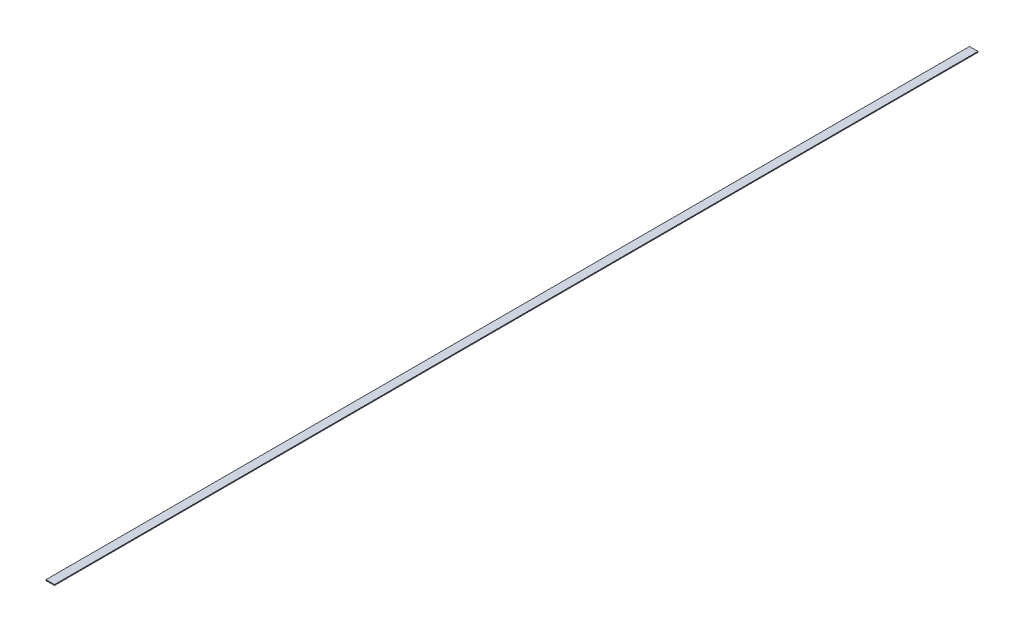
ISO-10303-21;
HEADER;
FILE_DESCRIPTION(('STEP AP214'),'2;1');
FILE_NAME('part.step','',(''),(''),'','','');
FILE_SCHEMA(('AUTOMOTIVE_DESIGN { 1 0 10303 214 1 1 1 1 }'));
ENDSEC;
DATA;
#1=APPLICATION_CONTEXT('core data for automotive mechanical design processes');
#2=APPLICATION_PROTOCOL_DEFINITION('international standard','automotive_design',2000,#1);
#3=PRODUCT_CONTEXT('',#1,'mechanical');
#4=PRODUCT('Part','Part','',(#3));
#5=PRODUCT_RELATED_PRODUCT_CATEGORY('part','',(#4));
#6=PRODUCT_DEFINITION_FORMATION('','',#4);
#7=PRODUCT_DEFINITION_CONTEXT('part definition',#1,'design');
#8=PRODUCT_DEFINITION('design','',#6,#7);
#9=PRODUCT_DEFINITION_SHAPE('','',#8);
#10=(LENGTH_UNIT() NAMED_UNIT(*) SI_UNIT(.MILLI.,.METRE.));
#11=(NAMED_UNIT(*) PLANE_ANGLE_UNIT() SI_UNIT($,.RADIAN.));
#12=(NAMED_UNIT(*) SI_UNIT($,.STERADIAN.) SOLID_ANGLE_UNIT());
#13=UNCERTAINTY_MEASURE_WITH_UNIT(LENGTH_MEASURE(1.E-05),#10,'distance_accuracy_value','');
#14=(GEOMETRIC_REPRESENTATION_CONTEXT(3) GLOBAL_UNCERTAINTY_ASSIGNED_CONTEXT((#13)) GLOBAL_UNIT_ASSIGNED_CONTEXT((#10,
#11,#12)) REPRESENTATION_CONTEXT('',''));
#15=CARTESIAN_POINT('',(0.,0.,0.));
#16=DIRECTION('',(0.,0.,1.));
#17=DIRECTION('',(1.,0.,0.));
#18=AXIS2_PLACEMENT_3D('',#15,#16,#17);
#19=CARTESIAN_POINT('',(0.,5.08,0.));
#20=DIRECTION('',(1.,0.,0.));
#21=DIRECTION('',(0.,0.,-1.));
#22=AXIS2_PLACEMENT_3D('',#19,#20,#21);
#23=PLANE('',#22);
#24=DIRECTION('',(0.,0.,1.));
#25=VECTOR('',#24,1.);
#26=CARTESIAN_POINT('',(0.,0.,0.));
#27=LINE('',#26,#25);
#28=CARTESIAN_POINT('',(0.,0.,-5518.15));
#29=VERTEX_POINT('',#28);
#30=CARTESIAN_POINT('',(0.,0.,0.));
#31=VERTEX_POINT('',#30);
#32=EDGE_CURVE('E97',#29,#31,#27,.T.);
#33=ORIENTED_EDGE('',*,*,#32,.T.);
#34=DIRECTION('',(0.,-1.,0.));
#35=VECTOR('',#34,1.);
#36=CARTESIAN_POINT('',(0.,5.08,0.));
#37=LINE('',#36,#35);
#38=CARTESIAN_POINT('',(0.,5.08,0.));
#39=VERTEX_POINT('',#38);
#40=EDGE_CURVE('E11',#39,#31,#37,.T.);
#41=ORIENTED_EDGE('',*,*,#40,.F.);
#42=DIRECTION('',(0.,0.,1.));
#43=VECTOR('',#42,1.);
#44=CARTESIAN_POINT('',(0.,5.08,0.));
#45=LINE('',#44,#43);
#46=CARTESIAN_POINT('',(0.,5.08,-5518.15));
#47=VERTEX_POINT('',#46);
#48=EDGE_CURVE('E85',#47,#39,#45,.T.);
#49=ORIENTED_EDGE('',*,*,#48,.F.);
#50=DIRECTION('',(0.,-1.,0.));
#51=VECTOR('',#50,1.);
#52=CARTESIAN_POINT('',(0.,5.08,-5518.15));
#53=LINE('',#52,#51);
#54=EDGE_CURVE('E93',#47,#29,#53,.T.);
#55=ORIENTED_EDGE('',*,*,#54,.T.);
#56=EDGE_LOOP('',(#33,#41,#49,#55));
#57=FACE_BOUND('',#56,.T.);
#58=ADVANCED_FACE('F34',(#57),#23,.F.);
#59=CARTESIAN_POINT('',(0.,5.08,0.));
#60=DIRECTION('',(0.,0.,-1.));
#61=DIRECTION('',(-1.,0.,0.));
#62=AXIS2_PLACEMENT_3D('',#59,#60,#61);
#63=PLANE('',#62);
#64=DIRECTION('',(1.,0.,0.));
#65=VECTOR('',#64,1.);
#66=CARTESIAN_POINT('',(0.,0.,0.));
#67=LINE('',#66,#65);
#68=CARTESIAN_POINT('',(50.8,0.,0.));
#69=VERTEX_POINT('',#68);
#70=EDGE_CURVE('E89',#31,#69,#67,.T.);
#71=ORIENTED_EDGE('',*,*,#70,.T.);
#72=DIRECTION('',(0.,-1.,0.));
#73=VECTOR('',#72,1.);
#74=CARTESIAN_POINT('',(50.8,5.08,0.));
#75=LINE('',#74,#73);
#76=CARTESIAN_POINT('',(50.8,5.08,0.));
#77=VERTEX_POINT('',#76);
#78=EDGE_CURVE('E42',#77,#69,#75,.T.);
#79=ORIENTED_EDGE('',*,*,#78,.F.);
#80=DIRECTION('',(1.,0.,0.));
#81=VECTOR('',#80,1.);
#82=CARTESIAN_POINT('',(0.,5.08,0.));
#83=LINE('',#82,#81);
#84=EDGE_CURVE('E80',#39,#77,#83,.T.);
#85=ORIENTED_EDGE('',*,*,#84,.F.);
#86=ORIENTED_EDGE('',*,*,#40,.T.);
#87=EDGE_LOOP('',(#71,#79,#85,#86));
#88=FACE_BOUND('',#87,.T.);
#89=ADVANCED_FACE('F88',(#88),#63,.F.);
#90=CARTESIAN_POINT('',(50.8,5.08,0.));
#91=DIRECTION('',(-1.,0.,0.));
#92=DIRECTION('',(0.,0.,1.));
#93=AXIS2_PLACEMENT_3D('',#90,#91,#92);
#94=PLANE('',#93);
#95=DIRECTION('',(0.,0.,-1.));
#96=VECTOR('',#95,1.);
#97=CARTESIAN_POINT('',(50.8,0.,0.));
#98=LINE('',#97,#96);
#99=CARTESIAN_POINT('',(50.8,0.,-5518.15));
#100=VERTEX_POINT('',#99);
#101=EDGE_CURVE('E67',#69,#100,#98,.T.);
#102=ORIENTED_EDGE('',*,*,#101,.T.);
#103=DIRECTION('',(0.,-1.,0.));
#104=VECTOR('',#103,1.);
#105=CARTESIAN_POINT('',(50.8,5.08,-5518.15));
#106=LINE('',#105,#104);
#107=CARTESIAN_POINT('',(50.8,5.08,-5518.15));
#108=VERTEX_POINT('',#107);
#109=EDGE_CURVE('E90',#108,#100,#106,.T.);
#110=ORIENTED_EDGE('',*,*,#109,.F.);
#111=DIRECTION('',(0.,0.,-1.));
#112=VECTOR('',#111,1.);
#113=CARTESIAN_POINT('',(50.8,5.08,0.));
#114=LINE('',#113,#112);
#115=EDGE_CURVE('E83',#77,#108,#114,.T.);
#116=ORIENTED_EDGE('',*,*,#115,.F.);
#117=ORIENTED_EDGE('',*,*,#78,.T.);
#118=EDGE_LOOP('',(#102,#110,#116,#117));
#119=FACE_BOUND('',#118,.T.);
#120=ADVANCED_FACE('F91',(#119),#94,.F.);
#121=CARTESIAN_POINT('',(0.,5.08,-5518.15));
#122=DIRECTION('',(0.,0.,1.));
#123=DIRECTION('',(1.,0.,0.));
#124=AXIS2_PLACEMENT_3D('',#121,#122,#123);
#125=PLANE('',#124);
#126=DIRECTION('',(-1.,0.,0.));
#127=VECTOR('',#126,1.);
#128=CARTESIAN_POINT('',(0.,0.,-5518.15));
#129=LINE('',#128,#127);
#130=EDGE_CURVE('E73',#100,#29,#129,.T.);
#131=ORIENTED_EDGE('',*,*,#130,.T.);
#132=ORIENTED_EDGE('',*,*,#54,.F.);
#133=DIRECTION('',(-1.,0.,0.));
#134=VECTOR('',#133,1.);
#135=CARTESIAN_POINT('',(0.,5.08,-5518.15));
#136=LINE('',#135,#134);
#137=EDGE_CURVE('E50',#108,#47,#136,.T.);
#138=ORIENTED_EDGE('',*,*,#137,.F.);
#139=ORIENTED_EDGE('',*,*,#109,.T.);
#140=EDGE_LOOP('',(#131,#132,#138,#139));
#141=FACE_BOUND('',#140,.T.);
#142=ADVANCED_FACE('F104',(#141),#125,.F.);
#143=CARTESIAN_POINT('',(0.,5.08,0.));
#144=DIRECTION('',(0.,-1.,0.));
#145=DIRECTION('',(0.,0.,-1.));
#146=AXIS2_PLACEMENT_3D('',#143,#144,#145);
#147=PLANE('',#146);
#148=ORIENTED_EDGE('',*,*,#48,.T.);
#149=ORIENTED_EDGE('',*,*,#84,.T.);
#150=ORIENTED_EDGE('',*,*,#115,.T.);
#151=ORIENTED_EDGE('',*,*,#137,.T.);
#152=EDGE_LOOP('',(#148,#149,#150,#151));
#153=FACE_BOUND('',#152,.T.);
#154=ADVANCED_FACE('F81',(#153),#147,.F.);
#155=CARTESIAN_POINT('',(0.,0.,0.));
#156=DIRECTION('',(0.,-1.,0.));
#157=DIRECTION('',(0.,0.,-1.));
#158=AXIS2_PLACEMENT_3D('',#155,#156,#157);
#159=PLANE('',#158);
#160=ORIENTED_EDGE('',*,*,#32,.F.);
#161=ORIENTED_EDGE('',*,*,#130,.F.);
#162=ORIENTED_EDGE('',*,*,#101,.F.);
#163=ORIENTED_EDGE('',*,*,#70,.F.);
#164=EDGE_LOOP('',(#160,#161,#162,#163));
#165=FACE_BOUND('',#164,.T.);
#166=ADVANCED_FACE('F107',(#165),#159,.T.);
#167=CLOSED_SHELL('',(#58,#89,#120,#142,#154,#166));
#168=MANIFOLD_SOLID_BREP('B2',#167);
#169=ADVANCED_BREP_SHAPE_REPRESENTATION('',(#18,#168),#14);
#170=SHAPE_DEFINITION_REPRESENTATION(#9,#169);
ENDSEC;
END-ISO-10303-21;
